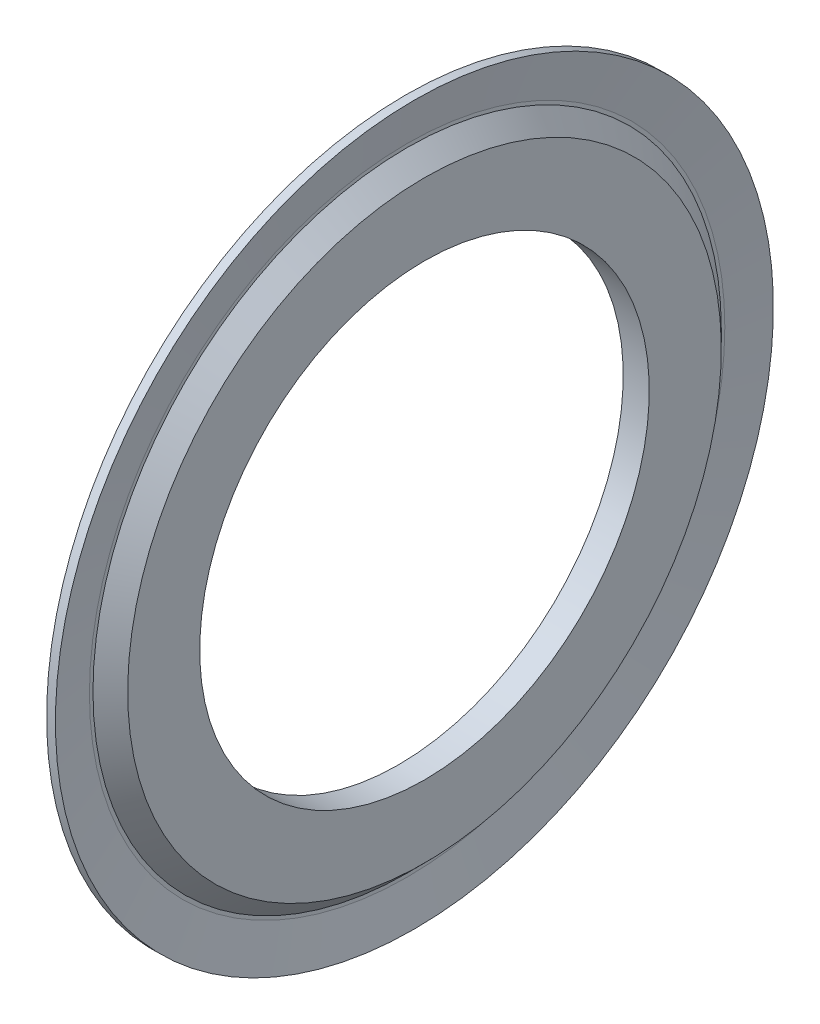
ISO-10303-21;
HEADER;
FILE_DESCRIPTION(('STEP AP214'),'2;1');
FILE_NAME('part.step','',(''),(''),'','','');
FILE_SCHEMA(('AUTOMOTIVE_DESIGN { 1 0 10303 214 1 1 1 1 }'));
ENDSEC;
DATA;
#1=APPLICATION_CONTEXT('core data for automotive mechanical design processes');
#2=APPLICATION_PROTOCOL_DEFINITION('international standard','automotive_design',2000,#1);
#3=PRODUCT_CONTEXT('',#1,'mechanical');
#4=PRODUCT('Part','Part','',(#3));
#5=PRODUCT_RELATED_PRODUCT_CATEGORY('part','',(#4));
#6=PRODUCT_DEFINITION_FORMATION('','',#4);
#7=PRODUCT_DEFINITION_CONTEXT('part definition',#1,'design');
#8=PRODUCT_DEFINITION('design','',#6,#7);
#9=PRODUCT_DEFINITION_SHAPE('','',#8);
#10=(LENGTH_UNIT() NAMED_UNIT(*) SI_UNIT(.MILLI.,.METRE.));
#11=(NAMED_UNIT(*) PLANE_ANGLE_UNIT() SI_UNIT($,.RADIAN.));
#12=(NAMED_UNIT(*) SI_UNIT($,.STERADIAN.) SOLID_ANGLE_UNIT());
#13=UNCERTAINTY_MEASURE_WITH_UNIT(LENGTH_MEASURE(1.E-05),#10,'distance_accuracy_value','');
#14=(GEOMETRIC_REPRESENTATION_CONTEXT(3) GLOBAL_UNCERTAINTY_ASSIGNED_CONTEXT((#13)) GLOBAL_UNIT_ASSIGNED_CONTEXT((#10,
#11,#12)) REPRESENTATION_CONTEXT('',''));
#15=CARTESIAN_POINT('',(0.,0.,0.));
#16=DIRECTION('',(0.,0.,1.));
#17=DIRECTION('',(1.,0.,0.));
#18=AXIS2_PLACEMENT_3D('',#15,#16,#17);
#19=CARTESIAN_POINT('',(6.06108145786646,8.691,0.));
#20=DIRECTION('',(-1.,0.,0.));
#21=DIRECTION('',(0.,-1.,0.));
#22=AXIS2_PLACEMENT_3D('',#19,#20,#21);
#23=PLANE('',#22);
#24=CARTESIAN_POINT('',(6.06108145786646,0.,0.));
#25=DIRECTION('',(1.,0.,0.));
#26=DIRECTION('',(0.,1.,0.));
#27=AXIS2_PLACEMENT_3D('',#24,#25,#26);
#28=CIRCLE('',#27,8.582);
#29=CARTESIAN_POINT('',(6.06108145786646,8.582,0.));
#30=VERTEX_POINT('',#29);
#31=EDGE_CURVE('E11',#30,#30,#28,.T.);
#32=ORIENTED_EDGE('',*,*,#31,.T.);
#33=EDGE_LOOP('',(#32));
#34=FACE_BOUND('',#33,.T.);
#35=CARTESIAN_POINT('',(6.06108145786646,0.,0.));
#36=DIRECTION('',(1.,0.,0.));
#37=DIRECTION('',(0.,1.,0.));
#38=AXIS2_PLACEMENT_3D('',#35,#36,#37);
#39=CIRCLE('',#38,8.8);
#40=CARTESIAN_POINT('',(6.06108145786646,8.8,0.));
#41=VERTEX_POINT('',#40);
#42=EDGE_CURVE('E70',#41,#41,#39,.T.);
#43=ORIENTED_EDGE('',*,*,#42,.F.);
#44=EDGE_LOOP('',(#43));
#45=FACE_BOUND('',#44,.T.);
#46=ADVANCED_FACE('F16',(#34,#45),#23,.T.);
#47=CARTESIAN_POINT('',(6.30108145786646,0.,0.));
#48=DIRECTION('',(-1.,0.,0.));
#49=DIRECTION('',(0.,1.,0.));
#50=AXIS2_PLACEMENT_3D('',#47,#48,#49);
#51=CONICAL_SURFACE('',#50,8.342,0.785398163397448);
#52=CARTESIAN_POINT('',(6.54108145786646,0.,0.));
#53=DIRECTION('',(1.,0.,0.));
#54=DIRECTION('',(0.,1.,0.));
#55=AXIS2_PLACEMENT_3D('',#52,#53,#54);
#56=CIRCLE('',#55,8.102);
#57=CARTESIAN_POINT('',(6.54108145786646,8.102,0.));
#58=VERTEX_POINT('',#57);
#59=EDGE_CURVE('E26',#58,#58,#56,.T.);
#60=ORIENTED_EDGE('',*,*,#59,.T.);
#61=EDGE_LOOP('',(#60));
#62=FACE_BOUND('',#61,.T.);
#63=ORIENTED_EDGE('',*,*,#31,.F.);
#64=EDGE_LOOP('',(#63));
#65=FACE_BOUND('',#64,.T.);
#66=ADVANCED_FACE('F106',(#62,#65),#51,.F.);
#67=CARTESIAN_POINT('',(6.54108145786646,7.276625,0.));
#68=DIRECTION('',(-1.,0.,0.));
#69=DIRECTION('',(0.,-1.,0.));
#70=AXIS2_PLACEMENT_3D('',#67,#68,#69);
#71=PLANE('',#70);
#72=CARTESIAN_POINT('',(6.54108145786646,0.,0.));
#73=DIRECTION('',(1.,0.,0.));
#74=DIRECTION('',(0.,1.,0.));
#75=AXIS2_PLACEMENT_3D('',#72,#73,#74);
#76=CIRCLE('',#75,6.45125);
#77=CARTESIAN_POINT('',(6.54108145786646,6.45125,0.));
#78=VERTEX_POINT('',#77);
#79=EDGE_CURVE('E62',#78,#78,#76,.T.);
#80=ORIENTED_EDGE('',*,*,#79,.T.);
#81=EDGE_LOOP('',(#80));
#82=FACE_BOUND('',#81,.T.);
#83=ORIENTED_EDGE('',*,*,#59,.F.);
#84=EDGE_LOOP('',(#83));
#85=FACE_BOUND('',#84,.T.);
#86=ADVANCED_FACE('F110',(#82,#85),#71,.T.);
#87=CARTESIAN_POINT('',(6.30108145786646,0.,0.));
#88=DIRECTION('',(-1.,0.,0.));
#89=DIRECTION('',(0.,1.,0.));
#90=AXIS2_PLACEMENT_3D('',#87,#88,#89);
#91=CYLINDRICAL_SURFACE('',#90,6.45125);
#92=CARTESIAN_POINT('',(6.06108145786646,0.,0.));
#93=DIRECTION('',(1.,0.,0.));
#94=DIRECTION('',(0.,1.,0.));
#95=AXIS2_PLACEMENT_3D('',#92,#93,#94);
#96=CIRCLE('',#95,6.45125);
#97=CARTESIAN_POINT('',(6.06108145786646,6.45125,0.));
#98=VERTEX_POINT('',#97);
#99=EDGE_CURVE('E58',#98,#98,#96,.T.);
#100=ORIENTED_EDGE('',*,*,#99,.T.);
#101=EDGE_LOOP('',(#100));
#102=FACE_BOUND('',#101,.T.);
#103=ORIENTED_EDGE('',*,*,#79,.F.);
#104=EDGE_LOOP('',(#103));
#105=FACE_BOUND('',#104,.T.);
#106=ADVANCED_FACE('F59',(#102,#105),#91,.T.);
#107=CARTESIAN_POINT('',(6.06108145786646,6.33125,0.));
#108=DIRECTION('',(-1.,0.,0.));
#109=DIRECTION('',(0.,-1.,0.));
#110=AXIS2_PLACEMENT_3D('',#107,#108,#109);
#111=PLANE('',#110);
#112=CARTESIAN_POINT('',(6.06108145786646,0.,0.));
#113=DIRECTION('',(1.,0.,0.));
#114=DIRECTION('',(0.,1.,0.));
#115=AXIS2_PLACEMENT_3D('',#112,#113,#114);
#116=CIRCLE('',#115,6.21125);
#117=CARTESIAN_POINT('',(6.06108145786646,6.21125,0.));
#118=VERTEX_POINT('',#117);
#119=EDGE_CURVE('E63',#118,#118,#116,.T.);
#120=ORIENTED_EDGE('',*,*,#119,.T.);
#121=EDGE_LOOP('',(#120));
#122=FACE_BOUND('',#121,.T.);
#123=ORIENTED_EDGE('',*,*,#99,.F.);
#124=EDGE_LOOP('',(#123));
#125=FACE_BOUND('',#124,.T.);
#126=ADVANCED_FACE('F139',(#122,#125),#111,.T.);
#127=CARTESIAN_POINT('',(6.42108145786646,0.,0.));
#128=DIRECTION('',(-1.,0.,0.));
#129=DIRECTION('',(0.,1.,0.));
#130=AXIS2_PLACEMENT_3D('',#127,#128,#129);
#131=CYLINDRICAL_SURFACE('',#130,6.21125);
#132=CARTESIAN_POINT('',(6.78108145786646,0.,0.));
#133=DIRECTION('',(1.,0.,0.));
#134=DIRECTION('',(0.,1.,0.));
#135=AXIS2_PLACEMENT_3D('',#132,#133,#134);
#136=CIRCLE('',#135,6.21125);
#137=CARTESIAN_POINT('',(6.78108145786646,6.21125,0.));
#138=VERTEX_POINT('',#137);
#139=EDGE_CURVE('E65',#138,#138,#136,.T.);
#140=ORIENTED_EDGE('',*,*,#139,.T.);
#141=EDGE_LOOP('',(#140));
#142=FACE_BOUND('',#141,.T.);
#143=ORIENTED_EDGE('',*,*,#119,.F.);
#144=EDGE_LOOP('',(#143));
#145=FACE_BOUND('',#144,.T.);
#146=ADVANCED_FACE('F101',(#142,#145),#131,.F.);
#147=CARTESIAN_POINT('',(6.78108145786646,7.20633062748477,0.));
#148=DIRECTION('',(1.,0.,0.));
#149=DIRECTION('',(0.,1.,0.));
#150=AXIS2_PLACEMENT_3D('',#147,#148,#149);
#151=PLANE('',#150);
#152=CARTESIAN_POINT('',(6.78108145786646,0.,0.));
#153=DIRECTION('',(1.,0.,0.));
#154=DIRECTION('',(0.,1.,0.));
#155=AXIS2_PLACEMENT_3D('',#152,#153,#154);
#156=CIRCLE('',#155,8.20141125496954);
#157=CARTESIAN_POINT('',(6.78108145786646,8.20141125496954,0.));
#158=VERTEX_POINT('',#157);
#159=EDGE_CURVE('E20',#158,#158,#156,.T.);
#160=ORIENTED_EDGE('',*,*,#159,.T.);
#161=EDGE_LOOP('',(#160));
#162=FACE_BOUND('',#161,.T.);
#163=ORIENTED_EDGE('',*,*,#139,.F.);
#164=EDGE_LOOP('',(#163));
#165=FACE_BOUND('',#164,.T.);
#166=ADVANCED_FACE('F87',(#162,#165),#151,.T.);
#167=CARTESIAN_POINT('',(6.54108145786646,0.,0.));
#168=DIRECTION('',(-1.,0.,0.));
#169=DIRECTION('',(0.,1.,0.));
#170=AXIS2_PLACEMENT_3D('',#167,#168,#169);
#171=CONICAL_SURFACE('',#170,8.44141125496954,0.78539816339745);
#172=CARTESIAN_POINT('',(6.30108145786646,0.,0.));
#173=DIRECTION('',(1.,0.,0.));
#174=DIRECTION('',(0.,1.,0.));
#175=AXIS2_PLACEMENT_3D('',#172,#173,#174);
#176=CIRCLE('',#175,8.68141125496954);
#177=CARTESIAN_POINT('',(6.30108145786646,8.68141125496954,0.));
#178=VERTEX_POINT('',#177);
#179=EDGE_CURVE('E72',#178,#178,#176,.T.);
#180=ORIENTED_EDGE('',*,*,#179,.T.);
#181=EDGE_LOOP('',(#180));
#182=FACE_BOUND('',#181,.T.);
#183=ORIENTED_EDGE('',*,*,#159,.F.);
#184=EDGE_LOOP('',(#183));
#185=FACE_BOUND('',#184,.T.);
#186=ADVANCED_FACE('F90',(#182,#185),#171,.T.);
#187=CARTESIAN_POINT('',(6.30108145786646,8.73020698786166,0.));
#188=DIRECTION('',(1.,0.,0.));
#189=DIRECTION('',(0.,1.,0.));
#190=AXIS2_PLACEMENT_3D('',#187,#188,#189);
#191=PLANE('',#190);
#192=CARTESIAN_POINT('',(6.30108145786646,0.,0.));
#193=DIRECTION('',(1.,0.,0.));
#194=DIRECTION('',(0.,1.,0.));
#195=AXIS2_PLACEMENT_3D('',#192,#193,#194);
#196=CIRCLE('',#195,8.77900272075378);
#197=CARTESIAN_POINT('',(6.30108145786646,8.77900272075378,0.));
#198=VERTEX_POINT('',#197);
#199=EDGE_CURVE('E73',#198,#198,#196,.T.);
#200=ORIENTED_EDGE('',*,*,#199,.T.);
#201=EDGE_LOOP('',(#200));
#202=FACE_BOUND('',#201,.T.);
#203=ORIENTED_EDGE('',*,*,#179,.F.);
#204=EDGE_LOOP('',(#203));
#205=FACE_BOUND('',#204,.T.);
#206=ADVANCED_FACE('F18',(#202,#205),#191,.T.);
#207=CARTESIAN_POINT('',(6.40167576048949,0.,0.));
#208=DIRECTION('',(1.,0.,0.));
#209=DIRECTION('',(0.,1.,0.));
#210=AXIS2_PLACEMENT_3D('',#207,#208,#209);
#211=CONICAL_SURFACE('',#210,9.34950136037689,1.39626340159546);
#212=CARTESIAN_POINT('',(6.50227006311252,0.,0.));
#213=DIRECTION('',(1.,0.,0.));
#214=DIRECTION('',(0.,1.,0.));
#215=AXIS2_PLACEMENT_3D('',#212,#213,#214);
#216=CIRCLE('',#215,9.92);
#217=CARTESIAN_POINT('',(6.50227006311252,9.92,0.));
#218=VERTEX_POINT('',#217);
#219=EDGE_CURVE('E75',#218,#218,#216,.T.);
#220=ORIENTED_EDGE('',*,*,#219,.T.);
#221=EDGE_LOOP('',(#220));
#222=FACE_BOUND('',#221,.T.);
#223=ORIENTED_EDGE('',*,*,#199,.F.);
#224=EDGE_LOOP('',(#223));
#225=FACE_BOUND('',#224,.T.);
#226=ADVANCED_FACE('F99',(#222,#225),#211,.F.);
#227=CARTESIAN_POINT('',(6.38041886968623,0.,0.));
#228=DIRECTION('',(-1.,0.,0.));
#229=DIRECTION('',(0.,1.,0.));
#230=AXIS2_PLACEMENT_3D('',#227,#228,#229);
#231=CYLINDRICAL_SURFACE('',#230,9.92);
#232=CARTESIAN_POINT('',(6.25856767625994,0.,0.));
#233=DIRECTION('',(1.,0.,0.));
#234=DIRECTION('',(0.,1.,0.));
#235=AXIS2_PLACEMENT_3D('',#232,#233,#234);
#236=CIRCLE('',#235,9.92);
#237=CARTESIAN_POINT('',(6.25856767625994,9.92,0.));
#238=VERTEX_POINT('',#237);
#239=EDGE_CURVE('E68',#238,#238,#236,.T.);
#240=ORIENTED_EDGE('',*,*,#239,.T.);
#241=EDGE_LOOP('',(#240));
#242=FACE_BOUND('',#241,.T.);
#243=ORIENTED_EDGE('',*,*,#219,.F.);
#244=EDGE_LOOP('',(#243));
#245=FACE_BOUND('',#244,.T.);
#246=ADVANCED_FACE('F116',(#242,#245),#231,.T.);
#247=CARTESIAN_POINT('',(6.1598245670632,0.,0.));
#248=DIRECTION('',(1.,0.,0.));
#249=DIRECTION('',(0.,1.,0.));
#250=AXIS2_PLACEMENT_3D('',#247,#248,#249);
#251=CONICAL_SURFACE('',#250,9.36,1.39626340159546);
#252=ORIENTED_EDGE('',*,*,#42,.T.);
#253=EDGE_LOOP('',(#252));
#254=FACE_BOUND('',#253,.T.);
#255=ORIENTED_EDGE('',*,*,#239,.F.);
#256=EDGE_LOOP('',(#255));
#257=FACE_BOUND('',#256,.T.);
#258=ADVANCED_FACE('F114',(#254,#257),#251,.T.);
#259=CLOSED_SHELL('',(#46,#66,#86,#106,#126,#146,#166,#186,#206,#226,#246,#258));
#260=MANIFOLD_SOLID_BREP('B1',#259);
#261=ADVANCED_BREP_SHAPE_REPRESENTATION('',(#18,#260),#14);
#262=SHAPE_DEFINITION_REPRESENTATION(#9,#261);
ENDSEC;
END-ISO-10303-21;
